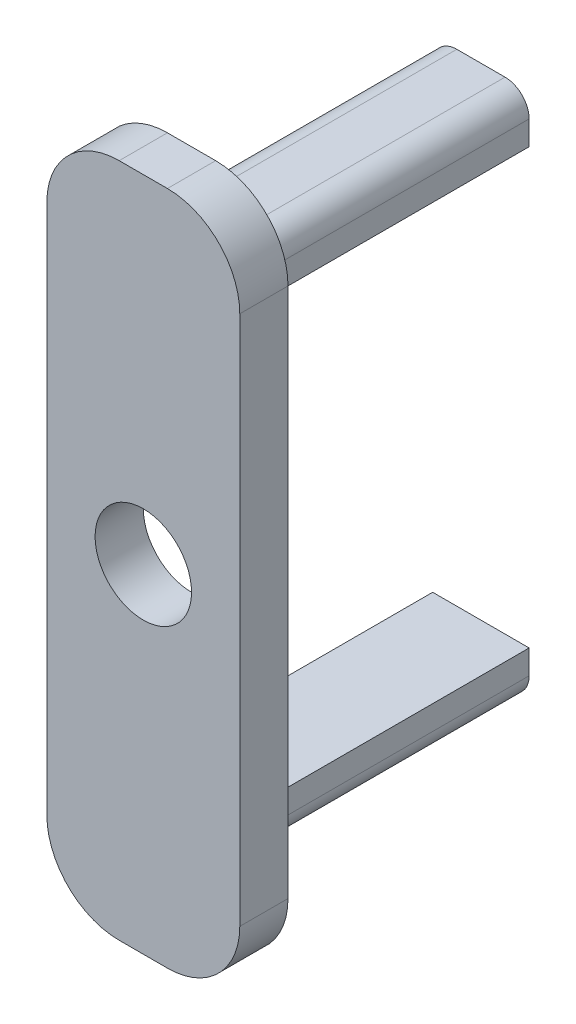
ISO-10303-21;
HEADER;
FILE_DESCRIPTION(('STEP AP214'),'2;1');
FILE_NAME('part.step','',(''),(''),'','','');
FILE_SCHEMA(('AUTOMOTIVE_DESIGN { 1 0 10303 214 1 1 1 1 }'));
ENDSEC;
DATA;
#1=APPLICATION_CONTEXT('core data for automotive mechanical design processes');
#2=APPLICATION_PROTOCOL_DEFINITION('international standard','automotive_design',2000,#1);
#3=PRODUCT_CONTEXT('',#1,'mechanical');
#4=PRODUCT('Part','Part','',(#3));
#5=PRODUCT_RELATED_PRODUCT_CATEGORY('part','',(#4));
#6=PRODUCT_DEFINITION_FORMATION('','',#4);
#7=PRODUCT_DEFINITION_CONTEXT('part definition',#1,'design');
#8=PRODUCT_DEFINITION('design','',#6,#7);
#9=PRODUCT_DEFINITION_SHAPE('','',#8);
#10=(LENGTH_UNIT() NAMED_UNIT(*) SI_UNIT(.MILLI.,.METRE.));
#11=(NAMED_UNIT(*) PLANE_ANGLE_UNIT() SI_UNIT($,.RADIAN.));
#12=(NAMED_UNIT(*) SI_UNIT($,.STERADIAN.) SOLID_ANGLE_UNIT());
#13=UNCERTAINTY_MEASURE_WITH_UNIT(LENGTH_MEASURE(1.E-05),#10,'distance_accuracy_value','');
#14=(GEOMETRIC_REPRESENTATION_CONTEXT(3) GLOBAL_UNCERTAINTY_ASSIGNED_CONTEXT((#13)) GLOBAL_UNIT_ASSIGNED_CONTEXT((#10,
#11,#12)) REPRESENTATION_CONTEXT('',''));
#15=CARTESIAN_POINT('',(0.,0.,0.));
#16=DIRECTION('',(0.,0.,1.));
#17=DIRECTION('',(1.,0.,0.));
#18=AXIS2_PLACEMENT_3D('',#15,#16,#17);
#19=CARTESIAN_POINT('',(-4.,-14.,2.));
#20=DIRECTION('',(1.,0.,0.));
#21=DIRECTION('',(0.,0.,-1.));
#22=AXIS2_PLACEMENT_3D('',#19,#20,#21);
#23=PLANE('',#22);
#24=DIRECTION('',(0.,-1.,0.));
#25=VECTOR('',#24,1.);
#26=CARTESIAN_POINT('',(-4.,-14.,0.));
#27=LINE('',#26,#25);
#28=CARTESIAN_POINT('',(-4.,11.,0.));
#29=VERTEX_POINT('',#28);
#30=CARTESIAN_POINT('',(-4.,-11.,0.));
#31=VERTEX_POINT('',#30);
#32=EDGE_CURVE('E249',#29,#31,#27,.T.);
#33=ORIENTED_EDGE('',*,*,#32,.T.);
#34=DIRECTION('',(0.,0.,-1.));
#35=VECTOR('',#34,1.);
#36=CARTESIAN_POINT('',(-4.,-11.,2.));
#37=LINE('',#36,#35);
#38=CARTESIAN_POINT('',(-4.,-11.,2.));
#39=VERTEX_POINT('',#38);
#40=EDGE_CURVE('E289',#31,#39,#37,.F.);
#41=ORIENTED_EDGE('',*,*,#40,.T.);
#42=DIRECTION('',(0.,-1.,0.));
#43=VECTOR('',#42,1.);
#44=CARTESIAN_POINT('',(-4.,-14.,2.));
#45=LINE('',#44,#43);
#46=CARTESIAN_POINT('',(-4.,11.,2.));
#47=VERTEX_POINT('',#46);
#48=EDGE_CURVE('E250',#47,#39,#45,.T.);
#49=ORIENTED_EDGE('',*,*,#48,.F.);
#50=DIRECTION('',(0.,0.,-1.));
#51=VECTOR('',#50,1.);
#52=CARTESIAN_POINT('',(-4.,11.,2.));
#53=LINE('',#52,#51);
#54=EDGE_CURVE('E286',#47,#29,#53,.T.);
#55=ORIENTED_EDGE('',*,*,#54,.T.);
#56=EDGE_LOOP('',(#33,#41,#49,#55));
#57=FACE_BOUND('',#56,.T.);
#58=ADVANCED_FACE('F39',(#57),#23,.F.);
#59=CARTESIAN_POINT('',(4.,-14.,2.));
#60=DIRECTION('',(0.,1.,0.));
#61=DIRECTION('',(0.,0.,1.));
#62=AXIS2_PLACEMENT_3D('',#59,#60,#61);
#63=PLANE('',#62);
#64=DIRECTION('',(1.,0.,0.));
#65=VECTOR('',#64,1.);
#66=CARTESIAN_POINT('',(4.,-14.,2.));
#67=LINE('',#66,#65);
#68=CARTESIAN_POINT('',(-1.,-14.,2.));
#69=VERTEX_POINT('',#68);
#70=CARTESIAN_POINT('',(1.,-14.,2.));
#71=VERTEX_POINT('',#70);
#72=EDGE_CURVE('E253',#69,#71,#67,.T.);
#73=ORIENTED_EDGE('',*,*,#72,.F.);
#74=DIRECTION('',(0.,0.,-1.));
#75=VECTOR('',#74,1.);
#76=CARTESIAN_POINT('',(-1.,-14.,2.));
#77=LINE('',#76,#75);
#78=CARTESIAN_POINT('',(-1.,-14.,0.));
#79=VERTEX_POINT('',#78);
#80=EDGE_CURVE('E275',#69,#79,#77,.T.);
#81=ORIENTED_EDGE('',*,*,#80,.T.);
#82=DIRECTION('',(1.,0.,0.));
#83=VECTOR('',#82,1.);
#84=CARTESIAN_POINT('',(4.,-14.,0.));
#85=LINE('',#84,#83);
#86=CARTESIAN_POINT('',(1.,-14.,0.));
#87=VERTEX_POINT('',#86);
#88=EDGE_CURVE('E266',#79,#87,#85,.T.);
#89=ORIENTED_EDGE('',*,*,#88,.T.);
#90=DIRECTION('',(0.,0.,-1.));
#91=VECTOR('',#90,1.);
#92=CARTESIAN_POINT('',(1.,-14.,2.));
#93=LINE('',#92,#91);
#94=EDGE_CURVE('E263',#87,#71,#93,.F.);
#95=ORIENTED_EDGE('',*,*,#94,.T.);
#96=EDGE_LOOP('',(#73,#81,#89,#95));
#97=FACE_BOUND('',#96,.T.);
#98=ADVANCED_FACE('F369',(#97),#63,.F.);
#99=CARTESIAN_POINT('',(4.,-14.,2.));
#100=DIRECTION('',(-1.,0.,0.));
#101=DIRECTION('',(0.,0.,1.));
#102=AXIS2_PLACEMENT_3D('',#99,#100,#101);
#103=PLANE('',#102);
#104=DIRECTION('',(0.,1.,0.));
#105=VECTOR('',#104,1.);
#106=CARTESIAN_POINT('',(4.,-14.,2.));
#107=LINE('',#106,#105);
#108=CARTESIAN_POINT('',(4.,-11.,2.));
#109=VERTEX_POINT('',#108);
#110=CARTESIAN_POINT('',(4.,11.,2.));
#111=VERTEX_POINT('',#110);
#112=EDGE_CURVE('E257',#109,#111,#107,.T.);
#113=ORIENTED_EDGE('',*,*,#112,.F.);
#114=DIRECTION('',(0.,0.,-1.));
#115=VECTOR('',#114,1.);
#116=CARTESIAN_POINT('',(4.,-11.,2.));
#117=LINE('',#116,#115);
#118=CARTESIAN_POINT('',(4.,-11.,0.));
#119=VERTEX_POINT('',#118);
#120=EDGE_CURVE('E301',#109,#119,#117,.T.);
#121=ORIENTED_EDGE('',*,*,#120,.T.);
#122=DIRECTION('',(0.,1.,0.));
#123=VECTOR('',#122,1.);
#124=CARTESIAN_POINT('',(4.,-14.,0.));
#125=LINE('',#124,#123);
#126=CARTESIAN_POINT('',(4.,11.,0.));
#127=VERTEX_POINT('',#126);
#128=EDGE_CURVE('E269',#119,#127,#125,.T.);
#129=ORIENTED_EDGE('',*,*,#128,.T.);
#130=DIRECTION('',(0.,0.,-1.));
#131=VECTOR('',#130,1.);
#132=CARTESIAN_POINT('',(4.,11.,2.));
#133=LINE('',#132,#131);
#134=EDGE_CURVE('E299',#127,#111,#133,.F.);
#135=ORIENTED_EDGE('',*,*,#134,.T.);
#136=EDGE_LOOP('',(#113,#121,#129,#135));
#137=FACE_BOUND('',#136,.T.);
#138=ADVANCED_FACE('F375',(#137),#103,.F.);
#139=CARTESIAN_POINT('',(4.,14.,2.));
#140=DIRECTION('',(0.,-1.,0.));
#141=DIRECTION('',(0.,0.,-1.));
#142=AXIS2_PLACEMENT_3D('',#139,#140,#141);
#143=PLANE('',#142);
#144=DIRECTION('',(-1.,0.,0.));
#145=VECTOR('',#144,1.);
#146=CARTESIAN_POINT('',(4.,14.,0.));
#147=LINE('',#146,#145);
#148=CARTESIAN_POINT('',(1.,14.,0.));
#149=VERTEX_POINT('',#148);
#150=CARTESIAN_POINT('',(-1.,14.,0.));
#151=VERTEX_POINT('',#150);
#152=EDGE_CURVE('E254',#149,#151,#147,.T.);
#153=ORIENTED_EDGE('',*,*,#152,.T.);
#154=DIRECTION('',(0.,0.,-1.));
#155=VECTOR('',#154,1.);
#156=CARTESIAN_POINT('',(-1.,14.,2.));
#157=LINE('',#156,#155);
#158=CARTESIAN_POINT('',(-1.,14.,2.));
#159=VERTEX_POINT('',#158);
#160=EDGE_CURVE('E307',#151,#159,#157,.F.);
#161=ORIENTED_EDGE('',*,*,#160,.T.);
#162=DIRECTION('',(-1.,0.,0.));
#163=VECTOR('',#162,1.);
#164=CARTESIAN_POINT('',(4.,14.,2.));
#165=LINE('',#164,#163);
#166=CARTESIAN_POINT('',(1.,14.,2.));
#167=VERTEX_POINT('',#166);
#168=EDGE_CURVE('E260',#167,#159,#165,.T.);
#169=ORIENTED_EDGE('',*,*,#168,.F.);
#170=DIRECTION('',(0.,0.,-1.));
#171=VECTOR('',#170,1.);
#172=CARTESIAN_POINT('',(1.,14.,2.));
#173=LINE('',#172,#171);
#174=EDGE_CURVE('E304',#167,#149,#173,.T.);
#175=ORIENTED_EDGE('',*,*,#174,.T.);
#176=EDGE_LOOP('',(#153,#161,#169,#175));
#177=FACE_BOUND('',#176,.T.);
#178=ADVANCED_FACE('F490',(#177),#143,.F.);
#179=CARTESIAN_POINT('',(0.,0.,2.));
#180=DIRECTION('',(0.,0.,1.));
#181=DIRECTION('',(1.,0.,0.));
#182=AXIS2_PLACEMENT_3D('',#179,#180,#181);
#183=PLANE('',#182);
#184=CARTESIAN_POINT('',(0.,0.,2.));
#185=DIRECTION('',(0.,0.,1.));
#186=DIRECTION('',(1.,0.,0.));
#187=AXIS2_PLACEMENT_3D('',#184,#185,#186);
#188=CIRCLE('',#187,2.);
#189=CARTESIAN_POINT('',(2.,0.,2.));
#190=VERTEX_POINT('',#189);
#191=EDGE_CURVE('E210',#190,#190,#188,.T.);
#192=ORIENTED_EDGE('',*,*,#191,.F.);
#193=EDGE_LOOP('',(#192));
#194=FACE_BOUND('',#193,.T.);
#195=ORIENTED_EDGE('',*,*,#48,.T.);
#196=CARTESIAN_POINT('',(-1.,-11.,2.));
#197=DIRECTION('',(0.,0.,1.));
#198=DIRECTION('',(1.,0.,0.));
#199=AXIS2_PLACEMENT_3D('',#196,#197,#198);
#200=CIRCLE('',#199,3.);
#201=EDGE_CURVE('E297',#39,#69,#200,.T.);
#202=ORIENTED_EDGE('',*,*,#201,.T.);
#203=ORIENTED_EDGE('',*,*,#72,.T.);
#204=CARTESIAN_POINT('',(1.,-11.,2.));
#205=DIRECTION('',(0.,0.,1.));
#206=DIRECTION('',(1.,0.,0.));
#207=AXIS2_PLACEMENT_3D('',#204,#205,#206);
#208=CIRCLE('',#207,3.);
#209=EDGE_CURVE('E295',#71,#109,#208,.T.);
#210=ORIENTED_EDGE('',*,*,#209,.T.);
#211=ORIENTED_EDGE('',*,*,#112,.T.);
#212=CARTESIAN_POINT('',(1.,11.,2.));
#213=DIRECTION('',(0.,0.,1.));
#214=DIRECTION('',(1.,0.,0.));
#215=AXIS2_PLACEMENT_3D('',#212,#213,#214);
#216=CIRCLE('',#215,3.);
#217=EDGE_CURVE('E291',#111,#167,#216,.T.);
#218=ORIENTED_EDGE('',*,*,#217,.T.);
#219=ORIENTED_EDGE('',*,*,#168,.T.);
#220=CARTESIAN_POINT('',(-1.,11.,2.));
#221=DIRECTION('',(0.,0.,1.));
#222=DIRECTION('',(1.,0.,0.));
#223=AXIS2_PLACEMENT_3D('',#220,#221,#222);
#224=CIRCLE('',#223,3.);
#225=EDGE_CURVE('E293',#159,#47,#224,.T.);
#226=ORIENTED_EDGE('',*,*,#225,.T.);
#227=EDGE_LOOP('',(#195,#202,#203,#210,#211,#218,#219,#226));
#228=FACE_BOUND('',#227,.T.);
#229=ADVANCED_FACE('F485',(#194,#228),#183,.T.);
#230=CARTESIAN_POINT('',(0.,0.,0.));
#231=DIRECTION('',(0.,0.,1.));
#232=DIRECTION('',(1.,0.,0.));
#233=AXIS2_PLACEMENT_3D('',#230,#231,#232);
#234=PLANE('',#233);
#235=CARTESIAN_POINT('',(0.,0.,0.));
#236=DIRECTION('',(0.,0.,-1.));
#237=DIRECTION('',(-1.,0.,0.));
#238=AXIS2_PLACEMENT_3D('',#235,#236,#237);
#239=CIRCLE('',#238,2.);
#240=CARTESIAN_POINT('',(-2.,0.,0.));
#241=VERTEX_POINT('',#240);
#242=EDGE_CURVE('E617',#241,#241,#239,.T.);
#243=ORIENTED_EDGE('',*,*,#242,.F.);
#244=EDGE_LOOP('',(#243));
#245=FACE_BOUND('',#244,.T.);
#246=DIRECTION('',(1.,0.,0.));
#247=VECTOR('',#246,1.);
#248=CARTESIAN_POINT('',(0.,-9.,0.));
#249=LINE('',#248,#247);
#250=CARTESIAN_POINT('',(-2.,-9.,0.));
#251=VERTEX_POINT('',#250);
#252=CARTESIAN_POINT('',(2.,-9.,0.));
#253=VERTEX_POINT('',#252);
#254=EDGE_CURVE('E218',#251,#253,#249,.T.);
#255=ORIENTED_EDGE('',*,*,#254,.F.);
#256=DIRECTION('',(0.,-1.,0.));
#257=VECTOR('',#256,1.);
#258=CARTESIAN_POINT('',(-2.,0.,0.));
#259=LINE('',#258,#257);
#260=CARTESIAN_POINT('',(-2.,-10.,0.));
#261=VERTEX_POINT('',#260);
#262=EDGE_CURVE('E185',#251,#261,#259,.T.);
#263=ORIENTED_EDGE('',*,*,#262,.T.);
#264=CARTESIAN_POINT('',(-1.,-10.,0.));
#265=DIRECTION('',(0.,0.,1.));
#266=DIRECTION('',(1.,0.,0.));
#267=AXIS2_PLACEMENT_3D('',#264,#265,#266);
#268=CIRCLE('',#267,1.);
#269=CARTESIAN_POINT('',(-1.,-11.,0.));
#270=VERTEX_POINT('',#269);
#271=EDGE_CURVE('E333',#261,#270,#268,.T.);
#272=ORIENTED_EDGE('',*,*,#271,.T.);
#273=DIRECTION('',(1.,0.,0.));
#274=VECTOR('',#273,1.);
#275=CARTESIAN_POINT('',(0.,-11.,0.));
#276=LINE('',#275,#274);
#277=CARTESIAN_POINT('',(1.,-11.,0.));
#278=VERTEX_POINT('',#277);
#279=EDGE_CURVE('E204',#270,#278,#276,.T.);
#280=ORIENTED_EDGE('',*,*,#279,.T.);
#281=CARTESIAN_POINT('',(1.,-10.,0.));
#282=DIRECTION('',(0.,0.,1.));
#283=DIRECTION('',(1.,0.,0.));
#284=AXIS2_PLACEMENT_3D('',#281,#282,#283);
#285=CIRCLE('',#284,1.);
#286=CARTESIAN_POINT('',(2.,-10.,0.));
#287=VERTEX_POINT('',#286);
#288=EDGE_CURVE('E335',#278,#287,#285,.T.);
#289=ORIENTED_EDGE('',*,*,#288,.T.);
#290=DIRECTION('',(0.,-1.,0.));
#291=VECTOR('',#290,1.);
#292=CARTESIAN_POINT('',(2.,0.,0.));
#293=LINE('',#292,#291);
#294=EDGE_CURVE('E207',#253,#287,#293,.T.);
#295=ORIENTED_EDGE('',*,*,#294,.F.);
#296=EDGE_LOOP('',(#255,#263,#272,#280,#289,#295));
#297=FACE_BOUND('',#296,.T.);
#298=DIRECTION('',(1.,0.,0.));
#299=VECTOR('',#298,1.);
#300=CARTESIAN_POINT('',(0.,9.,0.));
#301=LINE('',#300,#299);
#302=CARTESIAN_POINT('',(-2.,9.,0.));
#303=VERTEX_POINT('',#302);
#304=CARTESIAN_POINT('',(2.,9.,0.));
#305=VERTEX_POINT('',#304);
#306=EDGE_CURVE('E237',#303,#305,#301,.T.);
#307=ORIENTED_EDGE('',*,*,#306,.T.);
#308=DIRECTION('',(0.,1.,0.));
#309=VECTOR('',#308,1.);
#310=CARTESIAN_POINT('',(2.,0.,0.));
#311=LINE('',#310,#309);
#312=CARTESIAN_POINT('',(2.,10.,0.));
#313=VERTEX_POINT('',#312);
#314=EDGE_CURVE('E188',#305,#313,#311,.T.);
#315=ORIENTED_EDGE('',*,*,#314,.T.);
#316=CARTESIAN_POINT('',(1.,10.,0.));
#317=DIRECTION('',(0.,0.,1.));
#318=DIRECTION('',(1.,0.,0.));
#319=AXIS2_PLACEMENT_3D('',#316,#317,#318);
#320=CIRCLE('',#319,1.);
#321=CARTESIAN_POINT('',(1.,11.,0.));
#322=VERTEX_POINT('',#321);
#323=EDGE_CURVE('E11',#313,#322,#320,.T.);
#324=ORIENTED_EDGE('',*,*,#323,.T.);
#325=DIRECTION('',(1.,0.,0.));
#326=VECTOR('',#325,1.);
#327=CARTESIAN_POINT('',(0.,11.,0.));
#328=LINE('',#327,#326);
#329=CARTESIAN_POINT('',(-1.,11.,0.));
#330=VERTEX_POINT('',#329);
#331=EDGE_CURVE('E226',#330,#322,#328,.T.);
#332=ORIENTED_EDGE('',*,*,#331,.F.);
#333=CARTESIAN_POINT('',(-1.,10.,0.));
#334=DIRECTION('',(0.,0.,1.));
#335=DIRECTION('',(1.,0.,0.));
#336=AXIS2_PLACEMENT_3D('',#333,#334,#335);
#337=CIRCLE('',#336,1.);
#338=CARTESIAN_POINT('',(-2.,10.,0.));
#339=VERTEX_POINT('',#338);
#340=EDGE_CURVE('E47',#330,#339,#337,.T.);
#341=ORIENTED_EDGE('',*,*,#340,.T.);
#342=DIRECTION('',(0.,1.,0.));
#343=VECTOR('',#342,1.);
#344=CARTESIAN_POINT('',(-2.,0.,0.));
#345=LINE('',#344,#343);
#346=EDGE_CURVE('E239',#303,#339,#345,.T.);
#347=ORIENTED_EDGE('',*,*,#346,.F.);
#348=EDGE_LOOP('',(#307,#315,#324,#332,#341,#347));
#349=FACE_BOUND('',#348,.T.);
#350=ORIENTED_EDGE('',*,*,#88,.F.);
#351=CARTESIAN_POINT('',(-1.,-11.,0.));
#352=DIRECTION('',(0.,0.,1.));
#353=DIRECTION('',(1.,0.,0.));
#354=AXIS2_PLACEMENT_3D('',#351,#352,#353);
#355=CIRCLE('',#354,3.);
#356=EDGE_CURVE('E284',#79,#31,#355,.F.);
#357=ORIENTED_EDGE('',*,*,#356,.T.);
#358=ORIENTED_EDGE('',*,*,#32,.F.);
#359=CARTESIAN_POINT('',(-1.,11.,0.));
#360=DIRECTION('',(0.,0.,1.));
#361=DIRECTION('',(1.,0.,0.));
#362=AXIS2_PLACEMENT_3D('',#359,#360,#361);
#363=CIRCLE('',#362,3.);
#364=EDGE_CURVE('E280',#29,#151,#363,.F.);
#365=ORIENTED_EDGE('',*,*,#364,.T.);
#366=ORIENTED_EDGE('',*,*,#152,.F.);
#367=CARTESIAN_POINT('',(1.,11.,0.));
#368=DIRECTION('',(0.,0.,1.));
#369=DIRECTION('',(1.,0.,0.));
#370=AXIS2_PLACEMENT_3D('',#367,#368,#369);
#371=CIRCLE('',#370,3.);
#372=EDGE_CURVE('E278',#149,#127,#371,.F.);
#373=ORIENTED_EDGE('',*,*,#372,.T.);
#374=ORIENTED_EDGE('',*,*,#128,.F.);
#375=CARTESIAN_POINT('',(1.,-11.,0.));
#376=DIRECTION('',(0.,0.,1.));
#377=DIRECTION('',(1.,0.,0.));
#378=AXIS2_PLACEMENT_3D('',#375,#376,#377);
#379=CIRCLE('',#378,3.);
#380=EDGE_CURVE('E282',#119,#87,#379,.F.);
#381=ORIENTED_EDGE('',*,*,#380,.T.);
#382=EDGE_LOOP('',(#350,#357,#358,#365,#366,#373,#374,#381));
#383=FACE_BOUND('',#382,.T.);
#384=ADVANCED_FACE('F338',(#245,#297,#349,#383),#234,.F.);
#385=CARTESIAN_POINT('',(-1.,-11.,2.));
#386=DIRECTION('',(0.,0.,-1.));
#387=DIRECTION('',(-1.,0.,0.));
#388=AXIS2_PLACEMENT_3D('',#385,#386,#387);
#389=CYLINDRICAL_SURFACE('',#388,3.);
#390=ORIENTED_EDGE('',*,*,#201,.F.);
#391=ORIENTED_EDGE('',*,*,#40,.F.);
#392=ORIENTED_EDGE('',*,*,#356,.F.);
#393=ORIENTED_EDGE('',*,*,#80,.F.);
#394=EDGE_LOOP('',(#390,#391,#392,#393));
#395=FACE_BOUND('',#394,.T.);
#396=ADVANCED_FACE('F380',(#395),#389,.T.);
#397=CARTESIAN_POINT('',(1.,-11.,2.));
#398=DIRECTION('',(0.,0.,-1.));
#399=DIRECTION('',(-1.,0.,0.));
#400=AXIS2_PLACEMENT_3D('',#397,#398,#399);
#401=CYLINDRICAL_SURFACE('',#400,3.);
#402=ORIENTED_EDGE('',*,*,#209,.F.);
#403=ORIENTED_EDGE('',*,*,#94,.F.);
#404=ORIENTED_EDGE('',*,*,#380,.F.);
#405=ORIENTED_EDGE('',*,*,#120,.F.);
#406=EDGE_LOOP('',(#402,#403,#404,#405));
#407=FACE_BOUND('',#406,.T.);
#408=ADVANCED_FACE('F383',(#407),#401,.T.);
#409=CARTESIAN_POINT('',(-1.,11.,2.));
#410=DIRECTION('',(0.,0.,-1.));
#411=DIRECTION('',(-1.,0.,0.));
#412=AXIS2_PLACEMENT_3D('',#409,#410,#411);
#413=CYLINDRICAL_SURFACE('',#412,3.);
#414=ORIENTED_EDGE('',*,*,#225,.F.);
#415=ORIENTED_EDGE('',*,*,#160,.F.);
#416=ORIENTED_EDGE('',*,*,#364,.F.);
#417=ORIENTED_EDGE('',*,*,#54,.F.);
#418=EDGE_LOOP('',(#414,#415,#416,#417));
#419=FACE_BOUND('',#418,.T.);
#420=ADVANCED_FACE('F387',(#419),#413,.T.);
#421=CARTESIAN_POINT('',(1.,11.,2.));
#422=DIRECTION('',(0.,0.,-1.));
#423=DIRECTION('',(-1.,0.,0.));
#424=AXIS2_PLACEMENT_3D('',#421,#422,#423);
#425=CYLINDRICAL_SURFACE('',#424,3.);
#426=ORIENTED_EDGE('',*,*,#217,.F.);
#427=ORIENTED_EDGE('',*,*,#134,.F.);
#428=ORIENTED_EDGE('',*,*,#372,.F.);
#429=ORIENTED_EDGE('',*,*,#174,.F.);
#430=EDGE_LOOP('',(#426,#427,#428,#429));
#431=FACE_BOUND('',#430,.T.);
#432=ADVANCED_FACE('F366',(#431),#425,.T.);
#433=CARTESIAN_POINT('',(2.,0.,-12.));
#434=DIRECTION('',(1.,0.,0.));
#435=DIRECTION('',(0.,0.,-1.));
#436=AXIS2_PLACEMENT_3D('',#433,#434,#435);
#437=PLANE('',#436);
#438=DIRECTION('',(0.,1.,0.));
#439=VECTOR('',#438,1.);
#440=CARTESIAN_POINT('',(2.,0.,-12.));
#441=LINE('',#440,#439);
#442=CARTESIAN_POINT('',(2.,9.,-12.));
#443=VERTEX_POINT('',#442);
#444=CARTESIAN_POINT('',(2.,10.,-12.));
#445=VERTEX_POINT('',#444);
#446=EDGE_CURVE('E223',#443,#445,#441,.T.);
#447=ORIENTED_EDGE('',*,*,#446,.T.);
#448=DIRECTION('',(0.,0.,1.));
#449=VECTOR('',#448,1.);
#450=CARTESIAN_POINT('',(2.,10.,0.));
#451=LINE('',#450,#449);
#452=EDGE_CURVE('E331',#445,#313,#451,.T.);
#453=ORIENTED_EDGE('',*,*,#452,.T.);
#454=ORIENTED_EDGE('',*,*,#314,.F.);
#455=DIRECTION('',(0.,0.,1.));
#456=VECTOR('',#455,1.);
#457=CARTESIAN_POINT('',(2.,9.,-12.));
#458=LINE('',#457,#456);
#459=EDGE_CURVE('E246',#443,#305,#458,.T.);
#460=ORIENTED_EDGE('',*,*,#459,.F.);
#461=EDGE_LOOP('',(#447,#453,#454,#460));
#462=FACE_BOUND('',#461,.T.);
#463=ADVANCED_FACE('F356',(#462),#437,.T.);
#464=CARTESIAN_POINT('',(0.,9.,-12.));
#465=DIRECTION('',(0.,-1.,0.));
#466=DIRECTION('',(0.,0.,-1.));
#467=AXIS2_PLACEMENT_3D('',#464,#465,#466);
#468=PLANE('',#467);
#469=ORIENTED_EDGE('',*,*,#306,.F.);
#470=DIRECTION('',(0.,0.,1.));
#471=VECTOR('',#470,1.);
#472=CARTESIAN_POINT('',(-2.,9.,-12.));
#473=LINE('',#472,#471);
#474=CARTESIAN_POINT('',(-2.,9.,-12.));
#475=VERTEX_POINT('',#474);
#476=EDGE_CURVE('E234',#475,#303,#473,.T.);
#477=ORIENTED_EDGE('',*,*,#476,.F.);
#478=DIRECTION('',(1.,0.,0.));
#479=VECTOR('',#478,1.);
#480=CARTESIAN_POINT('',(0.,9.,-12.));
#481=LINE('',#480,#479);
#482=EDGE_CURVE('E225',#475,#443,#481,.T.);
#483=ORIENTED_EDGE('',*,*,#482,.T.);
#484=ORIENTED_EDGE('',*,*,#459,.T.);
#485=EDGE_LOOP('',(#469,#477,#483,#484));
#486=FACE_BOUND('',#485,.T.);
#487=ADVANCED_FACE('F358',(#486),#468,.T.);
#488=CARTESIAN_POINT('',(-2.,0.,-12.));
#489=DIRECTION('',(1.,0.,0.));
#490=DIRECTION('',(0.,0.,-1.));
#491=AXIS2_PLACEMENT_3D('',#488,#489,#490);
#492=PLANE('',#491);
#493=ORIENTED_EDGE('',*,*,#346,.T.);
#494=DIRECTION('',(0.,0.,1.));
#495=VECTOR('',#494,1.);
#496=CARTESIAN_POINT('',(-2.,10.,-12.));
#497=LINE('',#496,#495);
#498=CARTESIAN_POINT('',(-2.,10.,-12.));
#499=VERTEX_POINT('',#498);
#500=EDGE_CURVE('E326',#339,#499,#497,.F.);
#501=ORIENTED_EDGE('',*,*,#500,.T.);
#502=DIRECTION('',(0.,1.,0.));
#503=VECTOR('',#502,1.);
#504=CARTESIAN_POINT('',(-2.,0.,-12.));
#505=LINE('',#504,#503);
#506=EDGE_CURVE('E229',#475,#499,#505,.T.);
#507=ORIENTED_EDGE('',*,*,#506,.F.);
#508=ORIENTED_EDGE('',*,*,#476,.T.);
#509=EDGE_LOOP('',(#493,#501,#507,#508));
#510=FACE_BOUND('',#509,.T.);
#511=ADVANCED_FACE('F344',(#510),#492,.F.);
#512=CARTESIAN_POINT('',(0.,11.,-12.));
#513=DIRECTION('',(0.,-1.,0.));
#514=DIRECTION('',(1.,0.,0.));
#515=AXIS2_PLACEMENT_3D('',#512,#513,#514);
#516=PLANE('',#515);
#517=DIRECTION('',(1.,0.,0.));
#518=VECTOR('',#517,1.);
#519=CARTESIAN_POINT('',(0.,11.,-12.));
#520=LINE('',#519,#518);
#521=CARTESIAN_POINT('',(-1.,11.,-12.));
#522=VERTEX_POINT('',#521);
#523=CARTESIAN_POINT('',(1.,11.,-12.));
#524=VERTEX_POINT('',#523);
#525=EDGE_CURVE('E232',#522,#524,#520,.T.);
#526=ORIENTED_EDGE('',*,*,#525,.F.);
#527=DIRECTION('',(0.,0.,1.));
#528=VECTOR('',#527,1.);
#529=CARTESIAN_POINT('',(-1.,11.,-12.));
#530=LINE('',#529,#528);
#531=EDGE_CURVE('E323',#522,#330,#530,.T.);
#532=ORIENTED_EDGE('',*,*,#531,.T.);
#533=ORIENTED_EDGE('',*,*,#331,.T.);
#534=DIRECTION('',(0.,0.,1.));
#535=VECTOR('',#534,1.);
#536=CARTESIAN_POINT('',(1.,11.,-12.));
#537=LINE('',#536,#535);
#538=EDGE_CURVE('E321',#322,#524,#537,.F.);
#539=ORIENTED_EDGE('',*,*,#538,.T.);
#540=EDGE_LOOP('',(#526,#532,#533,#539));
#541=FACE_BOUND('',#540,.T.);
#542=ADVANCED_FACE('F353',(#541),#516,.F.);
#543=CARTESIAN_POINT('',(0.,0.,-12.));
#544=DIRECTION('',(0.,0.,-1.));
#545=DIRECTION('',(-1.,0.,0.));
#546=AXIS2_PLACEMENT_3D('',#543,#544,#545);
#547=PLANE('',#546);
#548=ORIENTED_EDGE('',*,*,#506,.T.);
#549=CARTESIAN_POINT('',(-1.,10.,-12.));
#550=DIRECTION('',(0.,0.,-1.));
#551=DIRECTION('',(-1.,0.,0.));
#552=AXIS2_PLACEMENT_3D('',#549,#550,#551);
#553=CIRCLE('',#552,1.);
#554=EDGE_CURVE('E329',#499,#522,#553,.T.);
#555=ORIENTED_EDGE('',*,*,#554,.T.);
#556=ORIENTED_EDGE('',*,*,#525,.T.);
#557=CARTESIAN_POINT('',(1.,10.,-12.));
#558=DIRECTION('',(0.,0.,-1.));
#559=DIRECTION('',(-1.,0.,0.));
#560=AXIS2_PLACEMENT_3D('',#557,#558,#559);
#561=CIRCLE('',#560,1.);
#562=EDGE_CURVE('E60',#524,#445,#561,.T.);
#563=ORIENTED_EDGE('',*,*,#562,.T.);
#564=ORIENTED_EDGE('',*,*,#446,.F.);
#565=ORIENTED_EDGE('',*,*,#482,.F.);
#566=EDGE_LOOP('',(#548,#555,#556,#563,#564,#565));
#567=FACE_BOUND('',#566,.T.);
#568=ADVANCED_FACE('F350',(#567),#547,.T.);
#569=CARTESIAN_POINT('',(-2.,0.,-12.));
#570=DIRECTION('',(-1.,0.,0.));
#571=DIRECTION('',(0.,0.,1.));
#572=AXIS2_PLACEMENT_3D('',#569,#570,#571);
#573=PLANE('',#572);
#574=DIRECTION('',(0.,-1.,0.));
#575=VECTOR('',#574,1.);
#576=CARTESIAN_POINT('',(-2.,0.,-12.));
#577=LINE('',#576,#575);
#578=CARTESIAN_POINT('',(-2.,-9.,-12.));
#579=VERTEX_POINT('',#578);
#580=CARTESIAN_POINT('',(-2.,-10.,-12.));
#581=VERTEX_POINT('',#580);
#582=EDGE_CURVE('E182',#579,#581,#577,.T.);
#583=ORIENTED_EDGE('',*,*,#582,.T.);
#584=DIRECTION('',(0.,0.,1.));
#585=VECTOR('',#584,1.);
#586=CARTESIAN_POINT('',(-2.,-10.,-12.));
#587=LINE('',#586,#585);
#588=EDGE_CURVE('E309',#581,#261,#587,.T.);
#589=ORIENTED_EDGE('',*,*,#588,.T.);
#590=ORIENTED_EDGE('',*,*,#262,.F.);
#591=DIRECTION('',(0.,0.,1.));
#592=VECTOR('',#591,1.);
#593=CARTESIAN_POINT('',(-2.,-9.,-12.));
#594=LINE('',#593,#592);
#595=EDGE_CURVE('E177',#579,#251,#594,.T.);
#596=ORIENTED_EDGE('',*,*,#595,.F.);
#597=EDGE_LOOP('',(#583,#589,#590,#596));
#598=FACE_BOUND('',#597,.T.);
#599=ADVANCED_FACE('F179',(#598),#573,.T.);
#600=CARTESIAN_POINT('',(0.,-9.,-12.));
#601=DIRECTION('',(0.,-1.,0.));
#602=DIRECTION('',(0.,0.,-1.));
#603=AXIS2_PLACEMENT_3D('',#600,#601,#602);
#604=PLANE('',#603);
#605=ORIENTED_EDGE('',*,*,#254,.T.);
#606=DIRECTION('',(0.,0.,1.));
#607=VECTOR('',#606,1.);
#608=CARTESIAN_POINT('',(2.,-9.,-12.));
#609=LINE('',#608,#607);
#610=CARTESIAN_POINT('',(2.,-9.,-12.));
#611=VERTEX_POINT('',#610);
#612=EDGE_CURVE('E189',#611,#253,#609,.T.);
#613=ORIENTED_EDGE('',*,*,#612,.F.);
#614=DIRECTION('',(1.,0.,0.));
#615=VECTOR('',#614,1.);
#616=CARTESIAN_POINT('',(0.,-9.,-12.));
#617=LINE('',#616,#615);
#618=EDGE_CURVE('E192',#579,#611,#617,.T.);
#619=ORIENTED_EDGE('',*,*,#618,.F.);
#620=ORIENTED_EDGE('',*,*,#595,.T.);
#621=EDGE_LOOP('',(#605,#613,#619,#620));
#622=FACE_BOUND('',#621,.T.);
#623=ADVANCED_FACE('F193',(#622),#604,.F.);
#624=CARTESIAN_POINT('',(2.,0.,-12.));
#625=DIRECTION('',(-1.,0.,0.));
#626=DIRECTION('',(0.,0.,1.));
#627=AXIS2_PLACEMENT_3D('',#624,#625,#626);
#628=PLANE('',#627);
#629=ORIENTED_EDGE('',*,*,#294,.T.);
#630=DIRECTION('',(0.,0.,1.));
#631=VECTOR('',#630,1.);
#632=CARTESIAN_POINT('',(2.,-10.,-12.));
#633=LINE('',#632,#631);
#634=CARTESIAN_POINT('',(2.,-10.,-12.));
#635=VERTEX_POINT('',#634);
#636=EDGE_CURVE('E319',#287,#635,#633,.F.);
#637=ORIENTED_EDGE('',*,*,#636,.T.);
#638=DIRECTION('',(0.,-1.,0.));
#639=VECTOR('',#638,1.);
#640=CARTESIAN_POINT('',(2.,0.,-12.));
#641=LINE('',#640,#639);
#642=EDGE_CURVE('E198',#611,#635,#641,.T.);
#643=ORIENTED_EDGE('',*,*,#642,.F.);
#644=ORIENTED_EDGE('',*,*,#612,.T.);
#645=EDGE_LOOP('',(#629,#637,#643,#644));
#646=FACE_BOUND('',#645,.T.);
#647=ADVANCED_FACE('F422',(#646),#628,.F.);
#648=CARTESIAN_POINT('',(0.,-11.,-12.));
#649=DIRECTION('',(0.,-1.,0.));
#650=DIRECTION('',(1.,0.,0.));
#651=AXIS2_PLACEMENT_3D('',#648,#649,#650);
#652=PLANE('',#651);
#653=ORIENTED_EDGE('',*,*,#279,.F.);
#654=DIRECTION('',(0.,0.,1.));
#655=VECTOR('',#654,1.);
#656=CARTESIAN_POINT('',(-1.,-11.,-12.));
#657=LINE('',#656,#655);
#658=CARTESIAN_POINT('',(-1.,-11.,-12.));
#659=VERTEX_POINT('',#658);
#660=EDGE_CURVE('E314',#270,#659,#657,.F.);
#661=ORIENTED_EDGE('',*,*,#660,.T.);
#662=DIRECTION('',(1.,0.,0.));
#663=VECTOR('',#662,1.);
#664=CARTESIAN_POINT('',(0.,-11.,-12.));
#665=LINE('',#664,#663);
#666=CARTESIAN_POINT('',(1.,-11.,-12.));
#667=VERTEX_POINT('',#666);
#668=EDGE_CURVE('E214',#659,#667,#665,.T.);
#669=ORIENTED_EDGE('',*,*,#668,.T.);
#670=DIRECTION('',(0.,0.,1.));
#671=VECTOR('',#670,1.);
#672=CARTESIAN_POINT('',(1.,-11.,0.));
#673=LINE('',#672,#671);
#674=EDGE_CURVE('E311',#667,#278,#673,.T.);
#675=ORIENTED_EDGE('',*,*,#674,.T.);
#676=EDGE_LOOP('',(#653,#661,#669,#675));
#677=FACE_BOUND('',#676,.T.);
#678=ADVANCED_FACE('F419',(#677),#652,.T.);
#679=CARTESIAN_POINT('',(0.,0.,-12.));
#680=DIRECTION('',(0.,0.,-1.));
#681=DIRECTION('',(-1.,0.,0.));
#682=AXIS2_PLACEMENT_3D('',#679,#680,#681);
#683=PLANE('',#682);
#684=ORIENTED_EDGE('',*,*,#668,.F.);
#685=CARTESIAN_POINT('',(-1.,-10.,-12.));
#686=DIRECTION('',(0.,0.,-1.));
#687=DIRECTION('',(-1.,0.,0.));
#688=AXIS2_PLACEMENT_3D('',#685,#686,#687);
#689=CIRCLE('',#688,1.);
#690=EDGE_CURVE('E203',#659,#581,#689,.T.);
#691=ORIENTED_EDGE('',*,*,#690,.T.);
#692=ORIENTED_EDGE('',*,*,#582,.F.);
#693=ORIENTED_EDGE('',*,*,#618,.T.);
#694=ORIENTED_EDGE('',*,*,#642,.T.);
#695=CARTESIAN_POINT('',(1.,-10.,-12.));
#696=DIRECTION('',(0.,0.,-1.));
#697=DIRECTION('',(-1.,0.,0.));
#698=AXIS2_PLACEMENT_3D('',#695,#696,#697);
#699=CIRCLE('',#698,1.);
#700=EDGE_CURVE('E316',#635,#667,#699,.T.);
#701=ORIENTED_EDGE('',*,*,#700,.T.);
#702=EDGE_LOOP('',(#684,#691,#692,#693,#694,#701));
#703=FACE_BOUND('',#702,.T.);
#704=ADVANCED_FACE('F201',(#703),#683,.T.);
#705=CARTESIAN_POINT('',(-1.,-10.,-12.));
#706=DIRECTION('',(0.,0.,1.));
#707=DIRECTION('',(1.,0.,0.));
#708=AXIS2_PLACEMENT_3D('',#705,#706,#707);
#709=CYLINDRICAL_SURFACE('',#708,1.);
#710=ORIENTED_EDGE('',*,*,#690,.F.);
#711=ORIENTED_EDGE('',*,*,#660,.F.);
#712=ORIENTED_EDGE('',*,*,#271,.F.);
#713=ORIENTED_EDGE('',*,*,#588,.F.);
#714=EDGE_LOOP('',(#710,#711,#712,#713));
#715=FACE_BOUND('',#714,.T.);
#716=ADVANCED_FACE('F395',(#715),#709,.T.);
#717=CARTESIAN_POINT('',(1.,-10.,-12.));
#718=DIRECTION('',(0.,0.,-1.));
#719=DIRECTION('',(-1.,0.,0.));
#720=AXIS2_PLACEMENT_3D('',#717,#718,#719);
#721=CYLINDRICAL_SURFACE('',#720,1.);
#722=ORIENTED_EDGE('',*,*,#700,.F.);
#723=ORIENTED_EDGE('',*,*,#636,.F.);
#724=ORIENTED_EDGE('',*,*,#288,.F.);
#725=ORIENTED_EDGE('',*,*,#674,.F.);
#726=EDGE_LOOP('',(#722,#723,#724,#725));
#727=FACE_BOUND('',#726,.T.);
#728=ADVANCED_FACE('F398',(#727),#721,.T.);
#729=CARTESIAN_POINT('',(-1.,10.,-12.));
#730=DIRECTION('',(0.,0.,1.));
#731=DIRECTION('',(1.,0.,0.));
#732=AXIS2_PLACEMENT_3D('',#729,#730,#731);
#733=CYLINDRICAL_SURFACE('',#732,1.);
#734=ORIENTED_EDGE('',*,*,#554,.F.);
#735=ORIENTED_EDGE('',*,*,#500,.F.);
#736=ORIENTED_EDGE('',*,*,#340,.F.);
#737=ORIENTED_EDGE('',*,*,#531,.F.);
#738=EDGE_LOOP('',(#734,#735,#736,#737));
#739=FACE_BOUND('',#738,.T.);
#740=ADVANCED_FACE('F348',(#739),#733,.T.);
#741=CARTESIAN_POINT('',(1.,10.,-12.));
#742=DIRECTION('',(0.,0.,-1.));
#743=DIRECTION('',(-1.,0.,0.));
#744=AXIS2_PLACEMENT_3D('',#741,#742,#743);
#745=CYLINDRICAL_SURFACE('',#744,1.);
#746=ORIENTED_EDGE('',*,*,#562,.F.);
#747=ORIENTED_EDGE('',*,*,#538,.F.);
#748=ORIENTED_EDGE('',*,*,#323,.F.);
#749=ORIENTED_EDGE('',*,*,#452,.F.);
#750=EDGE_LOOP('',(#746,#747,#748,#749));
#751=FACE_BOUND('',#750,.T.);
#752=ADVANCED_FACE('F41',(#751),#745,.T.);
#753=CARTESIAN_POINT('',(0.,0.,10.));
#754=DIRECTION('',(0.,0.,-1.));
#755=DIRECTION('',(-1.,0.,0.));
#756=AXIS2_PLACEMENT_3D('',#753,#754,#755);
#757=CYLINDRICAL_SURFACE('',#756,2.);
#758=ORIENTED_EDGE('',*,*,#191,.T.);
#759=EDGE_LOOP('',(#758));
#760=FACE_BOUND('',#759,.T.);
#761=ORIENTED_EDGE('',*,*,#242,.T.);
#762=EDGE_LOOP('',(#761));
#763=FACE_BOUND('',#762,.T.);
#764=ADVANCED_FACE('F406',(#760,#763),#757,.F.);
#765=CLOSED_SHELL('',(#58,#98,#138,#178,#229,#384,#396,#408,#420,#432,#463,#487,#511,#542,#568,
#599,#623,#647,#678,#704,#716,#728,#740,#752,#764));
#766=MANIFOLD_SOLID_BREP('B2',#765);
#767=ADVANCED_BREP_SHAPE_REPRESENTATION('',(#18,#766),#14);
#768=SHAPE_DEFINITION_REPRESENTATION(#9,#767);
ENDSEC;
END-ISO-10303-21;
